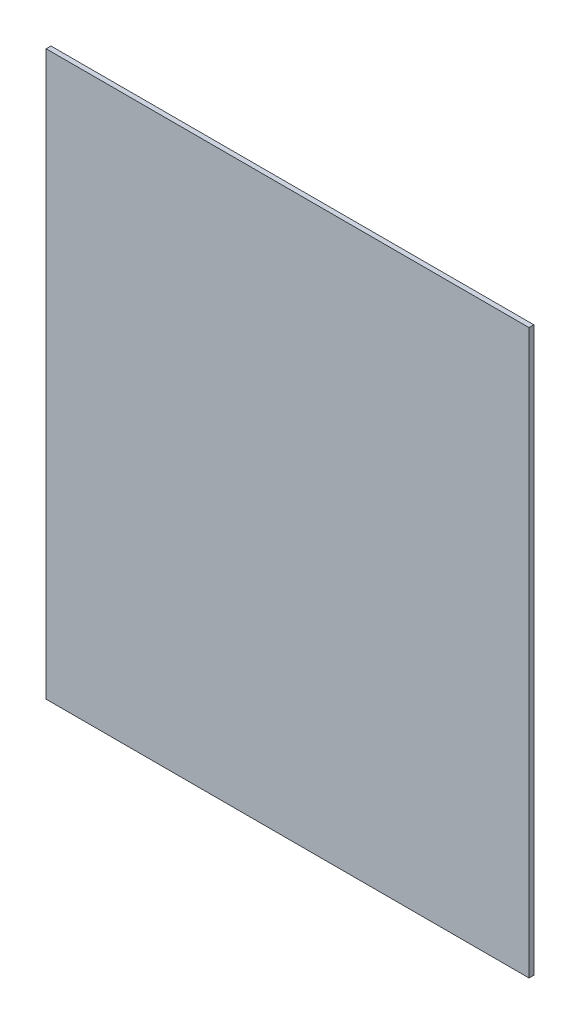
ISO-10303-21;
HEADER;
FILE_DESCRIPTION(('STEP AP214'),'2;1');
FILE_NAME('part.step','',(''),(''),'','','');
FILE_SCHEMA(('AUTOMOTIVE_DESIGN { 1 0 10303 214 1 1 1 1 }'));
ENDSEC;
DATA;
#1=APPLICATION_CONTEXT('core data for automotive mechanical design processes');
#2=APPLICATION_PROTOCOL_DEFINITION('international standard','automotive_design',2000,#1);
#3=PRODUCT_CONTEXT('',#1,'mechanical');
#4=PRODUCT('Part','Part','',(#3));
#5=PRODUCT_RELATED_PRODUCT_CATEGORY('part','',(#4));
#6=PRODUCT_DEFINITION_FORMATION('','',#4);
#7=PRODUCT_DEFINITION_CONTEXT('part definition',#1,'design');
#8=PRODUCT_DEFINITION('design','',#6,#7);
#9=PRODUCT_DEFINITION_SHAPE('','',#8);
#10=(LENGTH_UNIT() NAMED_UNIT(*) SI_UNIT(.MILLI.,.METRE.));
#11=(NAMED_UNIT(*) PLANE_ANGLE_UNIT() SI_UNIT($,.RADIAN.));
#12=(NAMED_UNIT(*) SI_UNIT($,.STERADIAN.) SOLID_ANGLE_UNIT());
#13=UNCERTAINTY_MEASURE_WITH_UNIT(LENGTH_MEASURE(1.E-05),#10,'distance_accuracy_value','');
#14=(GEOMETRIC_REPRESENTATION_CONTEXT(3) GLOBAL_UNCERTAINTY_ASSIGNED_CONTEXT((#13)) GLOBAL_UNIT_ASSIGNED_CONTEXT((#10,
#11,#12)) REPRESENTATION_CONTEXT('',''));
#15=CARTESIAN_POINT('',(0.,0.,0.));
#16=DIRECTION('',(0.,0.,1.));
#17=DIRECTION('',(1.,0.,0.));
#18=AXIS2_PLACEMENT_3D('',#15,#16,#17);
#19=CARTESIAN_POINT('',(0.,0.,3.));
#20=DIRECTION('',(1.,0.,0.));
#21=DIRECTION('',(0.,0.,-1.));
#22=AXIS2_PLACEMENT_3D('',#19,#20,#21);
#23=PLANE('',#22);
#24=DIRECTION('',(0.,-1.,0.));
#25=VECTOR('',#24,1.);
#26=CARTESIAN_POINT('',(0.,0.,0.));
#27=LINE('',#26,#25);
#28=CARTESIAN_POINT('',(0.,350.,0.));
#29=VERTEX_POINT('',#28);
#30=CARTESIAN_POINT('',(0.,0.,0.));
#31=VERTEX_POINT('',#30);
#32=EDGE_CURVE('E107',#29,#31,#27,.T.);
#33=ORIENTED_EDGE('',*,*,#32,.T.);
#34=DIRECTION('',(0.,0.,-1.));
#35=VECTOR('',#34,1.);
#36=CARTESIAN_POINT('',(0.,0.,3.));
#37=LINE('',#36,#35);
#38=CARTESIAN_POINT('',(0.,0.,3.));
#39=VERTEX_POINT('',#38);
#40=EDGE_CURVE('E11',#39,#31,#37,.T.);
#41=ORIENTED_EDGE('',*,*,#40,.F.);
#42=DIRECTION('',(0.,-1.,0.));
#43=VECTOR('',#42,1.);
#44=CARTESIAN_POINT('',(0.,0.,3.));
#45=LINE('',#44,#43);
#46=CARTESIAN_POINT('',(0.,350.,3.));
#47=VERTEX_POINT('',#46);
#48=EDGE_CURVE('E91',#47,#39,#45,.T.);
#49=ORIENTED_EDGE('',*,*,#48,.F.);
#50=DIRECTION('',(0.,0.,-1.));
#51=VECTOR('',#50,1.);
#52=CARTESIAN_POINT('',(0.,350.,3.));
#53=LINE('',#52,#51);
#54=EDGE_CURVE('E103',#47,#29,#53,.T.);
#55=ORIENTED_EDGE('',*,*,#54,.T.);
#56=EDGE_LOOP('',(#33,#41,#49,#55));
#57=FACE_BOUND('',#56,.T.);
#58=ADVANCED_FACE('F39',(#57),#23,.F.);
#59=CARTESIAN_POINT('',(0.,0.,3.));
#60=DIRECTION('',(0.,1.,0.));
#61=DIRECTION('',(0.,0.,1.));
#62=AXIS2_PLACEMENT_3D('',#59,#60,#61);
#63=PLANE('',#62);
#64=DIRECTION('',(1.,0.,0.));
#65=VECTOR('',#64,1.);
#66=CARTESIAN_POINT('',(0.,0.,0.));
#67=LINE('',#66,#65);
#68=CARTESIAN_POINT('',(300.,0.,0.));
#69=VERTEX_POINT('',#68);
#70=EDGE_CURVE('E96',#31,#69,#67,.T.);
#71=ORIENTED_EDGE('',*,*,#70,.T.);
#72=DIRECTION('',(0.,0.,-1.));
#73=VECTOR('',#72,1.);
#74=CARTESIAN_POINT('',(300.,0.,3.));
#75=LINE('',#74,#73);
#76=CARTESIAN_POINT('',(300.,0.,3.));
#77=VERTEX_POINT('',#76);
#78=EDGE_CURVE('E48',#77,#69,#75,.T.);
#79=ORIENTED_EDGE('',*,*,#78,.F.);
#80=DIRECTION('',(1.,0.,0.));
#81=VECTOR('',#80,1.);
#82=CARTESIAN_POINT('',(0.,0.,3.));
#83=LINE('',#82,#81);
#84=EDGE_CURVE('E86',#39,#77,#83,.T.);
#85=ORIENTED_EDGE('',*,*,#84,.F.);
#86=ORIENTED_EDGE('',*,*,#40,.T.);
#87=EDGE_LOOP('',(#71,#79,#85,#86));
#88=FACE_BOUND('',#87,.T.);
#89=ADVANCED_FACE('F95',(#88),#63,.F.);
#90=CARTESIAN_POINT('',(300.,0.,3.));
#91=DIRECTION('',(-1.,0.,0.));
#92=DIRECTION('',(0.,0.,1.));
#93=AXIS2_PLACEMENT_3D('',#90,#91,#92);
#94=PLANE('',#93);
#95=DIRECTION('',(0.,1.,0.));
#96=VECTOR('',#95,1.);
#97=CARTESIAN_POINT('',(300.,0.,0.));
#98=LINE('',#97,#96);
#99=CARTESIAN_POINT('',(300.,350.,0.));
#100=VERTEX_POINT('',#99);
#101=EDGE_CURVE('E73',#69,#100,#98,.T.);
#102=ORIENTED_EDGE('',*,*,#101,.T.);
#103=DIRECTION('',(0.,0.,-1.));
#104=VECTOR('',#103,1.);
#105=CARTESIAN_POINT('',(300.,350.,3.));
#106=LINE('',#105,#104);
#107=CARTESIAN_POINT('',(300.,350.,3.));
#108=VERTEX_POINT('',#107);
#109=EDGE_CURVE('E98',#108,#100,#106,.T.);
#110=ORIENTED_EDGE('',*,*,#109,.F.);
#111=DIRECTION('',(0.,1.,0.));
#112=VECTOR('',#111,1.);
#113=CARTESIAN_POINT('',(300.,0.,3.));
#114=LINE('',#113,#112);
#115=EDGE_CURVE('E89',#77,#108,#114,.T.);
#116=ORIENTED_EDGE('',*,*,#115,.F.);
#117=ORIENTED_EDGE('',*,*,#78,.T.);
#118=EDGE_LOOP('',(#102,#110,#116,#117));
#119=FACE_BOUND('',#118,.T.);
#120=ADVANCED_FACE('F99',(#119),#94,.F.);
#121=CARTESIAN_POINT('',(0.,350.,3.));
#122=DIRECTION('',(0.,-1.,0.));
#123=DIRECTION('',(0.,0.,-1.));
#124=AXIS2_PLACEMENT_3D('',#121,#122,#123);
#125=PLANE('',#124);
#126=DIRECTION('',(-1.,0.,0.));
#127=VECTOR('',#126,1.);
#128=CARTESIAN_POINT('',(0.,350.,0.));
#129=LINE('',#128,#127);
#130=EDGE_CURVE('E79',#100,#29,#129,.T.);
#131=ORIENTED_EDGE('',*,*,#130,.T.);
#132=ORIENTED_EDGE('',*,*,#54,.F.);
#133=DIRECTION('',(-1.,0.,0.));
#134=VECTOR('',#133,1.);
#135=CARTESIAN_POINT('',(0.,350.,3.));
#136=LINE('',#135,#134);
#137=EDGE_CURVE('E56',#108,#47,#136,.T.);
#138=ORIENTED_EDGE('',*,*,#137,.F.);
#139=ORIENTED_EDGE('',*,*,#109,.T.);
#140=EDGE_LOOP('',(#131,#132,#138,#139));
#141=FACE_BOUND('',#140,.T.);
#142=ADVANCED_FACE('F120',(#141),#125,.F.);
#143=CARTESIAN_POINT('',(0.,0.,3.));
#144=DIRECTION('',(0.,0.,-1.));
#145=DIRECTION('',(-1.,0.,0.));
#146=AXIS2_PLACEMENT_3D('',#143,#144,#145);
#147=PLANE('',#146);
#148=ORIENTED_EDGE('',*,*,#48,.T.);
#149=ORIENTED_EDGE('',*,*,#84,.T.);
#150=ORIENTED_EDGE('',*,*,#115,.T.);
#151=ORIENTED_EDGE('',*,*,#137,.T.);
#152=EDGE_LOOP('',(#148,#149,#150,#151));
#153=FACE_BOUND('',#152,.T.);
#154=ADVANCED_FACE('F87',(#153),#147,.F.);
#155=CARTESIAN_POINT('',(0.,0.,0.));
#156=DIRECTION('',(0.,0.,-1.));
#157=DIRECTION('',(-1.,0.,0.));
#158=AXIS2_PLACEMENT_3D('',#155,#156,#157);
#159=PLANE('',#158);
#160=ORIENTED_EDGE('',*,*,#32,.F.);
#161=ORIENTED_EDGE('',*,*,#130,.F.);
#162=ORIENTED_EDGE('',*,*,#101,.F.);
#163=ORIENTED_EDGE('',*,*,#70,.F.);
#164=EDGE_LOOP('',(#160,#161,#162,#163));
#165=FACE_BOUND('',#164,.T.);
#166=ADVANCED_FACE('F123',(#165),#159,.T.);
#167=CLOSED_SHELL('',(#58,#89,#120,#142,#154,#166));
#168=MANIFOLD_SOLID_BREP('B2',#167);
#169=ADVANCED_BREP_SHAPE_REPRESENTATION('',(#18,#168),#14);
#170=SHAPE_DEFINITION_REPRESENTATION(#9,#169);
ENDSEC;
END-ISO-10303-21;
